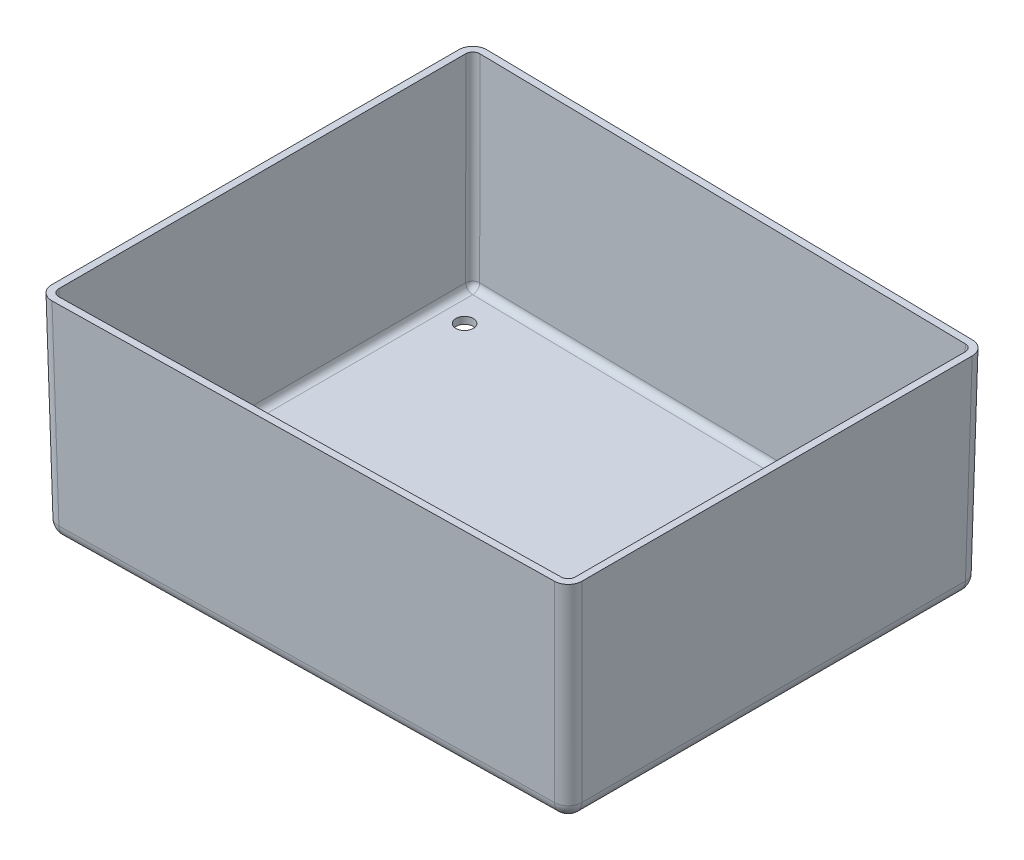
ISO-10303-21;
HEADER;
FILE_DESCRIPTION(('STEP AP214'),'2;1');
FILE_NAME('part.step','',(''),(''),'','','');
FILE_SCHEMA(('AUTOMOTIVE_DESIGN { 1 0 10303 214 1 1 1 1 }'));
ENDSEC;
DATA;
#1=APPLICATION_CONTEXT('core data for automotive mechanical design processes');
#2=APPLICATION_PROTOCOL_DEFINITION('international standard','automotive_design',2000,#1);
#3=PRODUCT_CONTEXT('',#1,'mechanical');
#4=PRODUCT('Part','Part','',(#3));
#5=PRODUCT_RELATED_PRODUCT_CATEGORY('part','',(#4));
#6=PRODUCT_DEFINITION_FORMATION('','',#4);
#7=PRODUCT_DEFINITION_CONTEXT('part definition',#1,'design');
#8=PRODUCT_DEFINITION('design','',#6,#7);
#9=PRODUCT_DEFINITION_SHAPE('','',#8);
#10=(LENGTH_UNIT() NAMED_UNIT(*) SI_UNIT(.MILLI.,.METRE.));
#11=(NAMED_UNIT(*) PLANE_ANGLE_UNIT() SI_UNIT($,.RADIAN.));
#12=(NAMED_UNIT(*) SI_UNIT($,.STERADIAN.) SOLID_ANGLE_UNIT());
#13=UNCERTAINTY_MEASURE_WITH_UNIT(LENGTH_MEASURE(1.E-05),#10,'distance_accuracy_value','');
#14=(GEOMETRIC_REPRESENTATION_CONTEXT(3) GLOBAL_UNCERTAINTY_ASSIGNED_CONTEXT((#13)) GLOBAL_UNIT_ASSIGNED_CONTEXT((#10,
#11,#12)) REPRESENTATION_CONTEXT('',''));
#15=CARTESIAN_POINT('',(0.,0.,0.));
#16=DIRECTION('',(0.,0.,1.));
#17=DIRECTION('',(1.,0.,0.));
#18=AXIS2_PLACEMENT_3D('',#15,#16,#17);
#19=CARTESIAN_POINT('',(-10247.3666463624,0.,-8079.38717390687));
#20=DIRECTION('',(-0.999847695156391,-0.0174524064372835,0.));
#21=DIRECTION('',(0.0174524064372835,-0.999847695156391,0.));
#22=AXIS2_PLACEMENT_3D('',#19,#20,#21);
#23=PLANE('',#22);
#24=DIRECTION('',(0.,0.,1.));
#25=VECTOR('',#24,1.);
#26=CARTESIAN_POINT('',(-10247.3666463624,0.,-8079.38717390687));
#27=LINE('',#26,#25);
#28=CARTESIAN_POINT('',(-10247.3666463624,0.,-7699.40344835078));
#29=VERTEX_POINT('',#28);
#30=CARTESIAN_POINT('',(-10247.3666463624,0.,22020.6291005371));
#31=VERTEX_POINT('',#30);
#32=EDGE_CURVE('E281',#29,#31,#27,.T.);
#33=ORIENTED_EDGE('',*,*,#32,.F.);
#34=DIRECTION('',(-0.0174495637852973,0.999684839733171,-0.0180481004919366));
#35=VECTOR('',#34,1.);
#36=CARTESIAN_POINT('',(-10247.4863151997,6.855823099923,-7699.52722194357));
#37=LINE('',#36,#35);
#38=CARTESIAN_POINT('',(-9998.77629580969,-14241.7316449403,-7442.28621130668));
#39=VERTEX_POINT('',#38);
#40=EDGE_CURVE('E60',#29,#39,#37,.F.);
#41=ORIENTED_EDGE('',*,*,#40,.T.);
#42=DIRECTION('',(0.,0.,1.));
#43=VECTOR('',#42,1.);
#44=CARTESIAN_POINT('',(-9998.77629580969,-14241.7316449403,-8079.38717390687));
#45=LINE('',#44,#43);
#46=CARTESIAN_POINT('',(-9998.77629580968,-14241.7316449403,21763.5118634929));
#47=VERTEX_POINT('',#46);
#48=EDGE_CURVE('E324',#39,#47,#45,.T.);
#49=ORIENTED_EDGE('',*,*,#48,.T.);
#50=DIRECTION('',(-0.0174495637852973,0.999684839733171,0.0180481004919366));
#51=VECTOR('',#50,1.);
#52=CARTESIAN_POINT('',(-10237.8872036668,-543.0769083081,22010.8245039018));
#53=LINE('',#52,#51);
#54=EDGE_CURVE('E322',#47,#31,#53,.T.);
#55=ORIENTED_EDGE('',*,*,#54,.T.);
#56=EDGE_LOOP('',(#33,#41,#49,#55));
#57=FACE_BOUND('',#56,.T.);
#58=ADVANCED_FACE('F35',(#57),#23,.T.);
#59=CARTESIAN_POINT('',(27852.6333536376,0.,-8079.38717390687));
#60=DIRECTION('',(0.017145254619604,-0.0177490206932787,-0.999695459881888));
#61=DIRECTION('',(0.,0.999842427401299,-0.0177516300174659));
#62=AXIS2_PLACEMENT_3D('',#59,#60,#61);
#63=PLANE('',#62);
#64=DIRECTION('',(-0.999852962994745,0.,-0.0171479558732175));
#65=VECTOR('',#64,1.);
#66=CARTESIAN_POINT('',(27848.2979737445,-14242.0330050244,-7826.60238346854));
#67=LINE('',#66,#65);
#68=CARTESIAN_POINT('',(26605.6173234996,-14242.0330050244,-7847.91495015942));
#69=VERTEX_POINT('',#68);
#70=CARTESIAN_POINT('',(-8965.51145883727,-14242.0330050244,-8457.97679854668));
#71=VERTEX_POINT('',#70);
#72=EDGE_CURVE('E318',#69,#71,#67,.T.);
#73=ORIENTED_EDGE('',*,*,#72,.T.);
#74=DIRECTION('',(-0.0174495637852973,0.999684839733171,-0.0180481004919366));
#75=VECTOR('',#74,1.);
#76=CARTESIAN_POINT('',(-9202.62051300037,-658.064389714291,-8703.21891976747));
#77=LINE('',#76,#75);
#78=CARTESIAN_POINT('',(-9214.10706964979,0.,-8715.09947628256));
#79=VERTEX_POINT('',#78);
#80=EDGE_CURVE('E320',#71,#79,#77,.T.);
#81=ORIENTED_EDGE('',*,*,#80,.T.);
#82=DIRECTION('',(-0.999852962994745,0.,-0.0171479558732175));
#83=VECTOR('',#82,1.);
#84=CARTESIAN_POINT('',(27852.6333536376,0.,-8079.38717390687));
#85=LINE('',#84,#83);
#86=CARTESIAN_POINT('',(26854.2129343121,0.,-8096.51056097194));
#87=VERTEX_POINT('',#86);
#88=EDGE_CURVE('E289',#87,#79,#85,.T.);
#89=ORIENTED_EDGE('',*,*,#88,.F.);
#90=DIRECTION('',(0.0174497491606827,0.999695459881888,-0.0174497491606827));
#91=VECTOR('',#90,1.);
#92=CARTESIAN_POINT('',(26854.5117331212,17.1181723067483,-8096.80935978101));
#93=LINE('',#92,#91);
#94=EDGE_CURVE('E316',#87,#69,#93,.F.);
#95=ORIENTED_EDGE('',*,*,#94,.T.);
#96=EDGE_LOOP('',(#73,#81,#89,#95));
#97=FACE_BOUND('',#96,.T.);
#98=ADVANCED_FACE('F393',(#97),#63,.T.);
#99=CARTESIAN_POINT('',(27852.6333536376,0.,-8079.38717390687));
#100=DIRECTION('',(0.999847695156391,-0.0174524064372835,0.));
#101=DIRECTION('',(0.0174524064372835,0.999847695156391,0.));
#102=AXIS2_PLACEMENT_3D('',#99,#100,#101);
#103=PLANE('',#102);
#104=DIRECTION('',(0.,0.,-1.));
#105=VECTOR('',#104,1.);
#106=CARTESIAN_POINT('',(27604.0430030849,-14241.7316449403,-8079.38717390687));
#107=LINE('',#106,#105);
#108=CARTESIAN_POINT('',(27604.0430030849,-14241.7316449403,21153.4500151057));
#109=VERTEX_POINT('',#108);
#110=CARTESIAN_POINT('',(27604.0430030849,-14241.7316449403,-6832.22436291942));
#111=VERTEX_POINT('',#110);
#112=EDGE_CURVE('E312',#109,#111,#107,.T.);
#113=ORIENTED_EDGE('',*,*,#112,.T.);
#114=DIRECTION('',(0.0174497491606827,0.999695459881888,-0.0174497491606827));
#115=VECTOR('',#114,1.);
#116=CARTESIAN_POINT('',(27852.9374127065,17.4195323908395,-7081.11877254101));
#117=LINE('',#116,#115);
#118=CARTESIAN_POINT('',(27852.6333536376,0.,-7080.81471347211));
#119=VERTEX_POINT('',#118);
#120=EDGE_CURVE('E314',#111,#119,#117,.T.);
#121=ORIENTED_EDGE('',*,*,#120,.T.);
#122=DIRECTION('',(0.,0.,-1.));
#123=VECTOR('',#122,1.);
#124=CARTESIAN_POINT('',(27852.6333536376,0.,-8079.38717390687));
#125=LINE('',#124,#123);
#126=CARTESIAN_POINT('',(27852.6333536376,0.,21402.0403656584));
#127=VERTEX_POINT('',#126);
#128=EDGE_CURVE('E286',#127,#119,#125,.T.);
#129=ORIENTED_EDGE('',*,*,#128,.F.);
#130=DIRECTION('',(0.0174497491606827,0.999695459881888,0.0174497491606827));
#131=VECTOR('',#130,1.);
#132=CARTESIAN_POINT('',(27843.6564433354,-514.286846775295,21393.0634553562));
#133=LINE('',#132,#131);
#134=EDGE_CURVE('E310',#127,#109,#133,.F.);
#135=ORIENTED_EDGE('',*,*,#134,.T.);
#136=EDGE_LOOP('',(#113,#121,#129,#135));
#137=FACE_BOUND('',#136,.T.);
#138=ADVANCED_FACE('F398',(#137),#103,.T.);
#139=CARTESIAN_POINT('',(27852.6333536376,0.,22400.6128260931));
#140=DIRECTION('',(0.0171452546196043,-0.0177490206932787,0.999695459881888));
#141=DIRECTION('',(0.,-0.999842427401299,-0.0177516300174659));
#142=AXIS2_PLACEMENT_3D('',#139,#140,#141);
#143=PLANE('',#142);
#144=DIRECTION('',(0.999852962994745,0.,-0.0171479558732177));
#145=VECTOR('',#144,1.);
#146=CARTESIAN_POINT('',(27848.2979737445,-14242.0330050244,22147.8280356548));
#147=LINE('',#146,#145);
#148=CARTESIAN_POINT('',(-8965.51145883727,-14242.0330050244,22779.2024507329));
#149=VERTEX_POINT('',#148);
#150=CARTESIAN_POINT('',(26605.6173234996,-14242.0330050244,22169.1406023457));
#151=VERTEX_POINT('',#150);
#152=EDGE_CURVE('E296',#149,#151,#147,.T.);
#153=ORIENTED_EDGE('',*,*,#152,.T.);
#154=DIRECTION('',(0.0174497491606827,0.999695459881888,0.0174497491606827));
#155=VECTOR('',#154,1.);
#156=CARTESIAN_POINT('',(26854.5117331212,17.1181723067484,22418.0350119673));
#157=LINE('',#156,#155);
#158=CARTESIAN_POINT('',(26854.2129343121,0.,22417.7362131582));
#159=VERTEX_POINT('',#158);
#160=EDGE_CURVE('E299',#151,#159,#157,.T.);
#161=ORIENTED_EDGE('',*,*,#160,.T.);
#162=DIRECTION('',(0.999852962994745,0.,-0.0171479558732177));
#163=VECTOR('',#162,1.);
#164=CARTESIAN_POINT('',(27852.6333536376,0.,22400.6128260931));
#165=LINE('',#164,#163);
#166=CARTESIAN_POINT('',(-9214.1070696498,0.,23036.3251284688));
#167=VERTEX_POINT('',#166);
#168=EDGE_CURVE('E284',#167,#159,#165,.T.);
#169=ORIENTED_EDGE('',*,*,#168,.F.);
#170=DIRECTION('',(-0.0174495637852973,0.999684839733171,0.0180481004919366));
#171=VECTOR('',#170,1.);
#172=CARTESIAN_POINT('',(-9202.62051300037,-658.064389714291,23024.4445719537));
#173=LINE('',#172,#171);
#174=EDGE_CURVE('E294',#167,#149,#173,.F.);
#175=ORIENTED_EDGE('',*,*,#174,.T.);
#176=EDGE_LOOP('',(#153,#161,#169,#175));
#177=FACE_BOUND('',#176,.T.);
#178=ADVANCED_FACE('F407',(#177),#143,.T.);
#179=CARTESIAN_POINT('',(0.,-15240.,0.));
#180=DIRECTION('',(0.,-1.,0.));
#181=DIRECTION('',(0.,0.,-1.));
#182=AXIS2_PLACEMENT_3D('',#179,#180,#181);
#183=PLANE('',#182);
#184=CARTESIAN_POINT('',(25445.1977448061,-15240.,19648.828893685));
#185=DIRECTION('',(0.,-1.,0.));
#186=DIRECTION('',(0.,0.,-1.));
#187=AXIS2_PLACEMENT_3D('',#184,#185,#186);
#188=CIRCLE('',#187,635.000000000003);
#189=CARTESIAN_POINT('',(25445.1977448061,-15240.,19013.828893685));
#190=VERTEX_POINT('',#189);
#191=EDGE_CURVE('E601',#190,#190,#188,.T.);
#192=ORIENTED_EDGE('',*,*,#191,.F.);
#193=EDGE_LOOP('',(#192));
#194=FACE_BOUND('',#193,.T.);
#195=CARTESIAN_POINT('',(-7458.93103753079,-15240.,19648.828893685));
#196=DIRECTION('',(0.,-1.,0.));
#197=DIRECTION('',(0.,0.,-1.));
#198=AXIS2_PLACEMENT_3D('',#195,#196,#197);
#199=CIRCLE('',#198,635.);
#200=CARTESIAN_POINT('',(-7458.93103753079,-15240.,19013.828893685));
#201=VERTEX_POINT('',#200);
#202=EDGE_CURVE('E598',#201,#201,#199,.T.);
#203=ORIENTED_EDGE('',*,*,#202,.F.);
#204=EDGE_LOOP('',(#203));
#205=FACE_BOUND('',#204,.T.);
#206=CARTESIAN_POINT('',(-7458.93103753079,-15240.,-5327.60324149877));
#207=DIRECTION('',(0.,-1.,0.));
#208=DIRECTION('',(0.,0.,-1.));
#209=AXIS2_PLACEMENT_3D('',#206,#207,#208);
#210=CIRCLE('',#209,635.);
#211=CARTESIAN_POINT('',(-7458.93103753079,-15240.,-5962.60324149877));
#212=VERTEX_POINT('',#211);
#213=EDGE_CURVE('E596',#212,#212,#210,.T.);
#214=ORIENTED_EDGE('',*,*,#213,.F.);
#215=EDGE_LOOP('',(#214));
#216=FACE_BOUND('',#215,.T.);
#217=CARTESIAN_POINT('',(25445.1977448061,-15240.,-5327.60324149877));
#218=DIRECTION('',(0.,-1.,0.));
#219=DIRECTION('',(0.,0.,-1.));
#220=AXIS2_PLACEMENT_3D('',#217,#218,#219);
#221=CIRCLE('',#220,635.000000000002);
#222=CARTESIAN_POINT('',(25445.1977448061,-15240.,-5962.60324149877));
#223=VERTEX_POINT('',#222);
#224=EDGE_CURVE('E368',#223,#223,#221,.T.);
#225=ORIENTED_EDGE('',*,*,#224,.F.);
#226=EDGE_LOOP('',(#225));
#227=FACE_BOUND('',#226,.T.);
#228=DIRECTION('',(0.,0.,-1.));
#229=VECTOR('',#228,1.);
#230=CARTESIAN_POINT('',(26588.197744806,-15240.,-3.09908969234334E-12));
#231=LINE('',#230,#229);
#232=CARTESIAN_POINT('',(26588.197744806,-15240.,-6832.22436291942));
#233=VERTEX_POINT('',#232);
#234=CARTESIAN_POINT('',(26588.1977448061,-15240.,21153.4500151057));
#235=VERTEX_POINT('',#234);
#236=EDGE_CURVE('E305',#233,#235,#231,.F.);
#237=ORIENTED_EDGE('',*,*,#236,.T.);
#238=DIRECTION('',(0.999852962994745,0.,-0.0171479558732177));
#239=VECTOR('',#238,1.);
#240=CARTESIAN_POINT('',(370.503414562687,-15240.,21603.0959951765));
#241=LINE('',#240,#239);
#242=CARTESIAN_POINT('',(-8982.93103753079,-15240.,21763.5118634929));
#243=VERTEX_POINT('',#242);
#244=EDGE_CURVE('E307',#235,#243,#241,.F.);
#245=ORIENTED_EDGE('',*,*,#244,.T.);
#246=DIRECTION('',(0.,0.,1.));
#247=VECTOR('',#246,1.);
#248=CARTESIAN_POINT('',(-8982.93103753079,-15240.,1.57056013645459E-12));
#249=LINE('',#248,#247);
#250=CARTESIAN_POINT('',(-8982.93103753079,-15240.,-7442.28621130668));
#251=VERTEX_POINT('',#250);
#252=EDGE_CURVE('E301',#243,#251,#249,.F.);
#253=ORIENTED_EDGE('',*,*,#252,.T.);
#254=DIRECTION('',(-0.999852962994745,0.,-0.0171479558732175));
#255=VECTOR('',#254,1.);
#256=CARTESIAN_POINT('',(124.959778338937,-15240.,-7286.08153363005));
#257=LINE('',#256,#255);
#258=EDGE_CURVE('E303',#251,#233,#257,.F.);
#259=ORIENTED_EDGE('',*,*,#258,.T.);
#260=EDGE_LOOP('',(#237,#245,#253,#259));
#261=FACE_BOUND('',#260,.T.);
#262=ADVANCED_FACE('F410',(#194,#205,#216,#227,#261),#183,.T.);
#263=CARTESIAN_POINT('',(0.,0.,0.));
#264=DIRECTION('',(0.,-1.,0.));
#265=DIRECTION('',(0.,0.,-1.));
#266=AXIS2_PLACEMENT_3D('',#263,#264,#265);
#267=PLANE('',#266);
#268=DIRECTION('',(-0.999852962994745,0.,-0.0171479558732175));
#269=VECTOR('',#268,1.);
#270=CARTESIAN_POINT('',(27843.920819601,0.,-7571.3818445183));
#271=LINE('',#270,#269);
#272=CARTESIAN_POINT('',(26845.3457613286,0.,-7588.50788371517));
#273=VERTEX_POINT('',#272);
#274=CARTESIAN_POINT('',(-9222.65947535977,0.,-8207.0914006167));
#275=VERTEX_POINT('',#274);
#276=EDGE_CURVE('E254',#273,#275,#271,.T.);
#277=ORIENTED_EDGE('',*,*,#276,.F.);
#278=CARTESIAN_POINT('',(26836.478588345,0.,-7080.50520645839));
#279=DIRECTION('',(0.,-1.,0.));
#280=DIRECTION('',(0.707106781186547,0.,-0.707106781186548));
#281=AXIS2_PLACEMENT_3D('',#278,#279,#280);
#282=ELLIPSE('',#281,508.154753508653,508.);
#283=CARTESIAN_POINT('',(27344.5559709913,0.,-7080.65995996525));
#284=VERTEX_POINT('',#283);
#285=EDGE_CURVE('E274',#284,#273,#282,.F.);
#286=ORIENTED_EDGE('',*,*,#285,.F.);
#287=DIRECTION('',(0.,0.,-1.));
#288=VECTOR('',#287,1.);
#289=CARTESIAN_POINT('',(27344.5559709913,0.,-8079.38717390687));
#290=LINE('',#289,#288);
#291=CARTESIAN_POINT('',(27344.5559709913,0.,21401.8856121515));
#292=VERTEX_POINT('',#291);
#293=EDGE_CURVE('E52',#292,#284,#290,.T.);
#294=ORIENTED_EDGE('',*,*,#293,.F.);
#295=CARTESIAN_POINT('',(26836.478588345,0.,21401.7308586446));
#296=DIRECTION('',(0.,-1.,0.));
#297=DIRECTION('',(0.707106781186548,0.,0.707106781186548));
#298=AXIS2_PLACEMENT_3D('',#295,#296,#297);
#299=ELLIPSE('',#298,508.154753508653,508.);
#300=CARTESIAN_POINT('',(26845.3457613286,0.,21909.7335359014));
#301=VERTEX_POINT('',#300);
#302=EDGE_CURVE('E270',#301,#292,#299,.F.);
#303=ORIENTED_EDGE('',*,*,#302,.F.);
#304=DIRECTION('',(0.999852962994745,0.,-0.0171479558732177));
#305=VECTOR('',#304,1.);
#306=CARTESIAN_POINT('',(27843.920819601,0.,21892.6074967046));
#307=LINE('',#306,#305);
#308=CARTESIAN_POINT('',(-9222.65947535977,0.,22528.317052803));
#309=VERTEX_POINT('',#308);
#310=EDGE_CURVE('E268',#309,#301,#307,.T.);
#311=ORIENTED_EDGE('',*,*,#310,.F.);
#312=CARTESIAN_POINT('',(-9231.21188106975,0.,22020.3089771371));
#313=DIRECTION('',(0.,-1.,0.));
#314=DIRECTION('',(-0.6950852422926,0.,0.718927330087706));
#315=AXIS2_PLACEMENT_3D('',#312,#313,#314);
#316=ELLIPSE('',#315,508.160151889061,508.);
#317=CARTESIAN_POINT('',(-9739.28926371606,0.,22020.4690388371));
#318=VERTEX_POINT('',#317);
#319=EDGE_CURVE('E186',#318,#309,#316,.F.);
#320=ORIENTED_EDGE('',*,*,#319,.F.);
#321=DIRECTION('',(0.,0.,1.));
#322=VECTOR('',#321,1.);
#323=CARTESIAN_POINT('',(-9739.28926371607,0.,-8079.38717390687));
#324=LINE('',#323,#322);
#325=CARTESIAN_POINT('',(-9739.28926371606,0.,-7699.24338665081));
#326=VERTEX_POINT('',#325);
#327=EDGE_CURVE('E244',#326,#318,#324,.T.);
#328=ORIENTED_EDGE('',*,*,#327,.F.);
#329=CARTESIAN_POINT('',(-9231.21188106975,0.,-7699.08332495084));
#330=DIRECTION('',(0.,-1.,0.));
#331=DIRECTION('',(-0.695085242292601,0.,-0.718927330087705));
#332=AXIS2_PLACEMENT_3D('',#329,#330,#331);
#333=ELLIPSE('',#332,508.160151889061,508.);
#334=EDGE_CURVE('E181',#275,#326,#333,.F.);
#335=ORIENTED_EDGE('',*,*,#334,.F.);
#336=EDGE_LOOP('',(#277,#286,#294,#303,#311,#320,#328,#335));
#337=FACE_BOUND('',#336,.T.);
#338=ORIENTED_EDGE('',*,*,#88,.T.);
#339=CARTESIAN_POINT('',(-9231.21188106975,0.,-7699.08332495084));
#340=DIRECTION('',(0.,-1.,0.));
#341=DIRECTION('',(-0.695085242292601,0.,-0.718927330087705));
#342=AXIS2_PLACEMENT_3D('',#339,#340,#341);
#343=ELLIPSE('',#342,1016.32030377812,1016.);
#344=EDGE_CURVE('E11',#79,#29,#343,.F.);
#345=ORIENTED_EDGE('',*,*,#344,.T.);
#346=ORIENTED_EDGE('',*,*,#32,.T.);
#347=CARTESIAN_POINT('',(-9231.21188106975,0.,22020.3089771371));
#348=DIRECTION('',(0.,-1.,0.));
#349=DIRECTION('',(-0.6950852422926,0.,0.718927330087706));
#350=AXIS2_PLACEMENT_3D('',#347,#348,#349);
#351=ELLIPSE('',#350,1016.32030377812,1016.);
#352=EDGE_CURVE('E327',#31,#167,#351,.F.);
#353=ORIENTED_EDGE('',*,*,#352,.T.);
#354=ORIENTED_EDGE('',*,*,#168,.T.);
#355=CARTESIAN_POINT('',(26836.478588345,0.,21401.7308586446));
#356=DIRECTION('',(0.,-1.,0.));
#357=DIRECTION('',(0.707106781186548,0.,0.707106781186548));
#358=AXIS2_PLACEMENT_3D('',#355,#356,#357);
#359=ELLIPSE('',#358,1016.30950701731,1016.);
#360=EDGE_CURVE('E329',#159,#127,#359,.F.);
#361=ORIENTED_EDGE('',*,*,#360,.T.);
#362=ORIENTED_EDGE('',*,*,#128,.T.);
#363=CARTESIAN_POINT('',(26836.478588345,0.,-7080.50520645839));
#364=DIRECTION('',(0.,-1.,0.));
#365=DIRECTION('',(0.707106781186547,0.,-0.707106781186548));
#366=AXIS2_PLACEMENT_3D('',#363,#364,#365);
#367=ELLIPSE('',#366,1016.30950701731,1016.);
#368=EDGE_CURVE('E44',#119,#87,#367,.F.);
#369=ORIENTED_EDGE('',*,*,#368,.T.);
#370=EDGE_LOOP('',(#338,#345,#346,#353,#354,#361,#362,#369));
#371=FACE_BOUND('',#370,.T.);
#372=ADVANCED_FACE('F403',(#337,#371),#267,.F.);
#373=CARTESIAN_POINT('',(-9220.04009169389,-640.031384689919,-7687.52833252747));
#374=DIRECTION('',(-0.0174495637852973,0.999684839733171,-0.0180481004919366));
#375=DIRECTION('',(0.,0.0180508488280581,0.999837070155226));
#376=AXIS2_PLACEMENT_3D('',#373,#374,#375);
#377=CYLINDRICAL_SURFACE('',#376,1016.);
#378=ORIENTED_EDGE('',*,*,#344,.F.);
#379=ORIENTED_EDGE('',*,*,#80,.F.);
#380=CARTESIAN_POINT('',(-8982.93103753079,-14224.,-7442.28621130668));
#381=DIRECTION('',(0.0174495637852975,-0.999684839733171,0.0180481004919366));
#382=DIRECTION('',(0.,-0.0180508488280582,-0.999837070155226));
#383=AXIS2_PLACEMENT_3D('',#380,#381,#382);
#384=CIRCLE('',#383,1016.);
#385=EDGE_CURVE('E359',#39,#71,#384,.T.);
#386=ORIENTED_EDGE('',*,*,#385,.F.);
#387=ORIENTED_EDGE('',*,*,#40,.F.);
#388=EDGE_LOOP('',(#378,#379,#386,#387));
#389=FACE_BOUND('',#388,.T.);
#390=ADVANCED_FACE('F37',(#389),#377,.T.);
#391=CARTESIAN_POINT('',(26837.0921544276,35.1511773311196,-7081.11877254101));
#392=DIRECTION('',(0.0174497491606827,0.999695459881888,-0.0174497491606827));
#393=DIRECTION('',(0.,0.0174524064372835,0.999847695156391));
#394=AXIS2_PLACEMENT_3D('',#391,#392,#393);
#395=CYLINDRICAL_SURFACE('',#394,1016.);
#396=ORIENTED_EDGE('',*,*,#368,.F.);
#397=ORIENTED_EDGE('',*,*,#120,.F.);
#398=CARTESIAN_POINT('',(26588.1977448061,-14224.,-6832.22436291942));
#399=DIRECTION('',(-0.0174497491606829,-0.999695459881888,0.0174497491606826));
#400=DIRECTION('',(0.999847695156391,-0.0174524064372838,0.));
#401=AXIS2_PLACEMENT_3D('',#398,#399,#400);
#402=CIRCLE('',#401,1016.);
#403=EDGE_CURVE('E356',#69,#111,#402,.T.);
#404=ORIENTED_EDGE('',*,*,#403,.F.);
#405=ORIENTED_EDGE('',*,*,#94,.F.);
#406=EDGE_LOOP('',(#396,#397,#404,#405));
#407=FACE_BOUND('',#406,.T.);
#408=ADVANCED_FACE('F451',(#407),#395,.T.);
#409=CARTESIAN_POINT('',(27830.878395051,-14224.,-6810.91179622854));
#410=DIRECTION('',(-0.999852962994745,0.,-0.0171479558732175));
#411=DIRECTION('',(-0.0171479558732175,0.,0.999852962994745));
#412=AXIS2_PLACEMENT_3D('',#409,#410,#411);
#413=CYLINDRICAL_SURFACE('',#412,1016.);
#414=CARTESIAN_POINT('',(-8982.93103753079,-14224.,-7442.28621130668));
#415=DIRECTION('',(-0.999852962994745,0.,-0.0171479558732182));
#416=DIRECTION('',(-0.0171479558732182,0.,0.999852962994745));
#417=AXIS2_PLACEMENT_3D('',#414,#415,#416);
#418=CIRCLE('',#417,1016.);
#419=EDGE_CURVE('E285',#71,#251,#418,.T.);
#420=ORIENTED_EDGE('',*,*,#419,.F.);
#421=ORIENTED_EDGE('',*,*,#72,.F.);
#422=CARTESIAN_POINT('',(26588.197744806,-14224.,-6832.22436291942));
#423=DIRECTION('',(0.999852962994745,0.,0.0171479558732198));
#424=DIRECTION('',(0.0171479558732198,0.,-0.999852962994745));
#425=AXIS2_PLACEMENT_3D('',#422,#423,#424);
#426=CIRCLE('',#425,1016.);
#427=EDGE_CURVE('E353',#233,#69,#426,.T.);
#428=ORIENTED_EDGE('',*,*,#427,.F.);
#429=ORIENTED_EDGE('',*,*,#258,.F.);
#430=EDGE_LOOP('',(#420,#421,#428,#429));
#431=FACE_BOUND('',#430,.T.);
#432=ADVANCED_FACE('F448',(#431),#413,.T.);
#433=CARTESIAN_POINT('',(-8982.93103753079,-14224.,-7442.28621130668));
#434=DIRECTION('',(0.,0.,1.));
#435=DIRECTION('',(1.,0.,0.));
#436=AXIS2_PLACEMENT_3D('',#433,#434,#435);
#437=SPHERICAL_SURFACE('',#436,1016.);
#438=ORIENTED_EDGE('',*,*,#385,.T.);
#439=ORIENTED_EDGE('',*,*,#419,.T.);
#440=CARTESIAN_POINT('',(-8982.93103753079,-14224.,-7442.28621130668));
#441=DIRECTION('',(0.,0.,-1.));
#442=DIRECTION('',(-1.,0.,0.));
#443=AXIS2_PLACEMENT_3D('',#440,#441,#442);
#444=CIRCLE('',#443,1016.);
#445=EDGE_CURVE('E350',#39,#251,#444,.F.);
#446=ORIENTED_EDGE('',*,*,#445,.F.);
#447=EDGE_LOOP('',(#438,#439,#446));
#448=FACE_BOUND('',#447,.T.);
#449=ADVANCED_FACE('F444',(#448),#437,.T.);
#450=CARTESIAN_POINT('',(26588.197744806,-14224.,-6832.22436291942));
#451=DIRECTION('',(0.,0.,1.));
#452=DIRECTION('',(1.,0.,0.));
#453=AXIS2_PLACEMENT_3D('',#450,#451,#452);
#454=SPHERICAL_SURFACE('',#453,1016.);
#455=ORIENTED_EDGE('',*,*,#427,.T.);
#456=ORIENTED_EDGE('',*,*,#403,.T.);
#457=CARTESIAN_POINT('',(26588.197744806,-14224.,-6832.22436291942));
#458=DIRECTION('',(0.,0.,-1.));
#459=DIRECTION('',(-1.,0.,0.));
#460=AXIS2_PLACEMENT_3D('',#457,#458,#459);
#461=CIRCLE('',#460,1016.);
#462=EDGE_CURVE('E347',#233,#111,#461,.F.);
#463=ORIENTED_EDGE('',*,*,#462,.F.);
#464=EDGE_LOOP('',(#455,#456,#463));
#465=FACE_BOUND('',#464,.T.);
#466=ADVANCED_FACE('F440',(#465),#454,.T.);
#467=CARTESIAN_POINT('',(-8982.93103753079,-14224.,-8079.38717390687));
#468=DIRECTION('',(0.,0.,1.));
#469=DIRECTION('',(1.,0.,0.));
#470=AXIS2_PLACEMENT_3D('',#467,#468,#469);
#471=CYLINDRICAL_SURFACE('',#470,1016.);
#472=ORIENTED_EDGE('',*,*,#445,.T.);
#473=ORIENTED_EDGE('',*,*,#252,.F.);
#474=CARTESIAN_POINT('',(-8982.93103753079,-14224.,21763.5118634929));
#475=DIRECTION('',(0.,0.,1.));
#476=DIRECTION('',(0.,-1.,0.));
#477=AXIS2_PLACEMENT_3D('',#474,#475,#476);
#478=CIRCLE('',#477,1016.);
#479=EDGE_CURVE('E344',#47,#243,#478,.T.);
#480=ORIENTED_EDGE('',*,*,#479,.F.);
#481=ORIENTED_EDGE('',*,*,#48,.F.);
#482=EDGE_LOOP('',(#472,#473,#480,#481));
#483=FACE_BOUND('',#482,.T.);
#484=ADVANCED_FACE('F436',(#483),#471,.T.);
#485=CARTESIAN_POINT('',(-9222.04194538794,-525.345263367819,22010.8245039018));
#486=DIRECTION('',(-0.0174495637852973,0.999684839733171,0.0180481004919366));
#487=DIRECTION('',(0.,-0.0180508488280581,0.999837070155226));
#488=AXIS2_PLACEMENT_3D('',#485,#486,#487);
#489=CYLINDRICAL_SURFACE('',#488,1016.);
#490=ORIENTED_EDGE('',*,*,#352,.F.);
#491=ORIENTED_EDGE('',*,*,#54,.F.);
#492=CARTESIAN_POINT('',(-8982.93103753079,-14224.,21763.5118634929));
#493=DIRECTION('',(0.0174495637852974,-0.999684839733171,-0.0180481004919365));
#494=DIRECTION('',(0.,0.018050848828058,-0.999837070155226));
#495=AXIS2_PLACEMENT_3D('',#492,#493,#494);
#496=CIRCLE('',#495,1016.);
#497=EDGE_CURVE('E341',#149,#47,#496,.T.);
#498=ORIENTED_EDGE('',*,*,#497,.F.);
#499=ORIENTED_EDGE('',*,*,#174,.F.);
#500=EDGE_LOOP('',(#490,#491,#498,#499));
#501=FACE_BOUND('',#500,.T.);
#502=ADVANCED_FACE('F432',(#501),#489,.T.);
#503=CARTESIAN_POINT('',(26837.0921544276,35.1511773311196,21402.3444247273));
#504=DIRECTION('',(0.0174497491606827,0.999695459881888,0.0174497491606827));
#505=DIRECTION('',(0.,-0.0174524064372835,0.999847695156391));
#506=AXIS2_PLACEMENT_3D('',#503,#504,#505);
#507=CYLINDRICAL_SURFACE('',#506,1016.);
#508=ORIENTED_EDGE('',*,*,#360,.F.);
#509=ORIENTED_EDGE('',*,*,#160,.F.);
#510=CARTESIAN_POINT('',(26588.1977448061,-14224.,21153.4500151057));
#511=DIRECTION('',(-0.0174497491606829,-0.999695459881888,-0.0174497491606826));
#512=DIRECTION('',(0.999847695156391,-0.0174524064372837,0.));
#513=AXIS2_PLACEMENT_3D('',#510,#511,#512);
#514=CIRCLE('',#513,1016.);
#515=EDGE_CURVE('E338',#109,#151,#514,.T.);
#516=ORIENTED_EDGE('',*,*,#515,.F.);
#517=ORIENTED_EDGE('',*,*,#134,.F.);
#518=EDGE_LOOP('',(#508,#509,#516,#517));
#519=FACE_BOUND('',#518,.T.);
#520=ADVANCED_FACE('F428',(#519),#507,.T.);
#521=CARTESIAN_POINT('',(26588.197744806,-14224.,-8079.38717390687));
#522=DIRECTION('',(0.,0.,-1.));
#523=DIRECTION('',(-1.,0.,0.));
#524=AXIS2_PLACEMENT_3D('',#521,#522,#523);
#525=CYLINDRICAL_SURFACE('',#524,1016.);
#526=ORIENTED_EDGE('',*,*,#462,.T.);
#527=ORIENTED_EDGE('',*,*,#112,.F.);
#528=CARTESIAN_POINT('',(26588.1977448061,-14224.,21153.4500151057));
#529=DIRECTION('',(0.,0.,1.));
#530=DIRECTION('',(1.,0.,0.));
#531=AXIS2_PLACEMENT_3D('',#528,#529,#530);
#532=CIRCLE('',#531,1016.);
#533=EDGE_CURVE('E335',#235,#109,#532,.T.);
#534=ORIENTED_EDGE('',*,*,#533,.F.);
#535=ORIENTED_EDGE('',*,*,#236,.F.);
#536=EDGE_LOOP('',(#526,#527,#534,#535));
#537=FACE_BOUND('',#536,.T.);
#538=ADVANCED_FACE('F424',(#537),#525,.T.);
#539=CARTESIAN_POINT('',(-8982.93103753079,-14224.,21763.5118634929));
#540=DIRECTION('',(0.,0.,1.));
#541=DIRECTION('',(1.,0.,0.));
#542=AXIS2_PLACEMENT_3D('',#539,#540,#541);
#543=SPHERICAL_SURFACE('',#542,1016.);
#544=ORIENTED_EDGE('',*,*,#497,.T.);
#545=ORIENTED_EDGE('',*,*,#479,.T.);
#546=CARTESIAN_POINT('',(-8982.93103753079,-14224.,21763.5118634929));
#547=DIRECTION('',(-0.999852962994745,0.,0.0171479558732198));
#548=DIRECTION('',(0.0171479558732198,0.,0.999852962994745));
#549=AXIS2_PLACEMENT_3D('',#546,#547,#548);
#550=CIRCLE('',#549,1016.);
#551=EDGE_CURVE('E333',#149,#243,#550,.F.);
#552=ORIENTED_EDGE('',*,*,#551,.F.);
#553=EDGE_LOOP('',(#544,#545,#552));
#554=FACE_BOUND('',#553,.T.);
#555=ADVANCED_FACE('F420',(#554),#543,.T.);
#556=CARTESIAN_POINT('',(26588.1977448061,-14224.,21153.4500151057));
#557=DIRECTION('',(0.,0.,1.));
#558=DIRECTION('',(1.,0.,0.));
#559=AXIS2_PLACEMENT_3D('',#556,#557,#558);
#560=SPHERICAL_SURFACE('',#559,1016.);
#561=ORIENTED_EDGE('',*,*,#533,.T.);
#562=ORIENTED_EDGE('',*,*,#515,.T.);
#563=CARTESIAN_POINT('',(26588.1977448061,-14224.,21153.4500151057));
#564=DIRECTION('',(0.999852962994745,0.,-0.0171479558732163));
#565=DIRECTION('',(-0.0171479558732163,0.,-0.999852962994745));
#566=AXIS2_PLACEMENT_3D('',#563,#564,#565);
#567=CIRCLE('',#566,1016.);
#568=EDGE_CURVE('E280',#235,#151,#567,.F.);
#569=ORIENTED_EDGE('',*,*,#568,.F.);
#570=EDGE_LOOP('',(#561,#562,#569));
#571=FACE_BOUND('',#570,.T.);
#572=ADVANCED_FACE('F416',(#571),#560,.T.);
#573=CARTESIAN_POINT('',(27830.878395051,-14224.,21132.1374484148));
#574=DIRECTION('',(0.999852962994745,0.,-0.0171479558732177));
#575=DIRECTION('',(-0.0171479558732177,0.,-0.999852962994745));
#576=AXIS2_PLACEMENT_3D('',#573,#574,#575);
#577=CYLINDRICAL_SURFACE('',#576,1016.);
#578=ORIENTED_EDGE('',*,*,#551,.T.);
#579=ORIENTED_EDGE('',*,*,#244,.F.);
#580=ORIENTED_EDGE('',*,*,#568,.T.);
#581=ORIENTED_EDGE('',*,*,#152,.F.);
#582=EDGE_LOOP('',(#578,#579,#580,#581));
#583=FACE_BOUND('',#582,.T.);
#584=ADVANCED_FACE('F413',(#583),#577,.T.);
#585=CARTESIAN_POINT('',(-9739.44401722292,8.86582247014004,-8079.38717390687));
#586=DIRECTION('',(-0.999847695156391,-0.0174524064372835,0.));
#587=DIRECTION('',(0.0174524064372835,-0.999847695156391,0.));
#588=AXIS2_PLACEMENT_3D('',#585,#586,#587);
#589=PLANE('',#588);
#590=ORIENTED_EDGE('',*,*,#327,.T.);
#591=DIRECTION('',(-0.0174495637852973,0.999684839733171,0.0180481004919366));
#592=VECTOR('',#591,1.);
#593=CARTESIAN_POINT('',(-9729.96457452738,-534.211085837959,22010.8245039018));
#594=LINE('',#593,#592);
#595=CARTESIAN_POINT('',(-9490.85366667023,-14232.8658224701,21763.5118634929));
#596=VERTEX_POINT('',#595);
#597=EDGE_CURVE('E210',#596,#318,#594,.T.);
#598=ORIENTED_EDGE('',*,*,#597,.F.);
#599=DIRECTION('',(0.,0.,1.));
#600=VECTOR('',#599,1.);
#601=CARTESIAN_POINT('',(-9490.85366667024,-14232.8658224701,-8079.38717390687));
#602=LINE('',#601,#600);
#603=CARTESIAN_POINT('',(-9490.85366667024,-14232.8658224701,-7442.28621130668));
#604=VERTEX_POINT('',#603);
#605=EDGE_CURVE('E187',#604,#596,#602,.T.);
#606=ORIENTED_EDGE('',*,*,#605,.F.);
#607=DIRECTION('',(-0.0174495637852973,0.999684839733171,-0.0180481004919366));
#608=VECTOR('',#607,1.);
#609=CARTESIAN_POINT('',(-9727.96272083334,-648.897207160059,-7687.52833252747));
#610=LINE('',#609,#608);
#611=EDGE_CURVE('E176',#326,#604,#610,.F.);
#612=ORIENTED_EDGE('',*,*,#611,.F.);
#613=EDGE_LOOP('',(#590,#598,#606,#612));
#614=FACE_BOUND('',#613,.T.);
#615=ADVANCED_FACE('F209',(#614),#589,.F.);
#616=CARTESIAN_POINT('',(27843.9235642909,9.0165025121856,-7571.54188028687));
#617=DIRECTION('',(0.017145254619604,-0.0177490206932787,-0.999695459881888));
#618=DIRECTION('',(0.,0.999842427401299,-0.0177516300174659));
#619=AXIS2_PLACEMENT_3D('',#616,#617,#618);
#620=PLANE('',#619);
#621=DIRECTION('',(-0.999852962994745,0.,-0.0171479558732175));
#622=VECTOR('',#621,1.);
#623=CARTESIAN_POINT('',(27839.5881843977,-14233.0165025122,-7318.75708984854));
#624=LINE('',#623,#622);
#625=CARTESIAN_POINT('',(26596.9075341528,-14233.0165025122,-7340.06965653942));
#626=VERTEX_POINT('',#625);
#627=CARTESIAN_POINT('',(-8974.22124818402,-14233.0165025122,-7950.13150492668));
#628=VERTEX_POINT('',#627);
#629=EDGE_CURVE('E217',#626,#628,#624,.T.);
#630=ORIENTED_EDGE('',*,*,#629,.F.);
#631=DIRECTION('',(0.0174497491606827,0.999695459881888,-0.0174497491606827));
#632=VECTOR('',#631,1.);
#633=CARTESIAN_POINT('',(26845.8019437744,26.134674818934,-7588.96406616101));
#634=LINE('',#633,#632);
#635=EDGE_CURVE('E220',#273,#626,#634,.F.);
#636=ORIENTED_EDGE('',*,*,#635,.F.);
#637=ORIENTED_EDGE('',*,*,#276,.T.);
#638=DIRECTION('',(-0.0174495637852973,0.999684839733171,-0.0180481004919366));
#639=VECTOR('',#638,1.);
#640=CARTESIAN_POINT('',(-9211.33030234713,-649.047887202105,-8195.37362614747));
#641=LINE('',#640,#639);
#642=EDGE_CURVE('E213',#628,#275,#641,.T.);
#643=ORIENTED_EDGE('',*,*,#642,.F.);
#644=EDGE_LOOP('',(#630,#636,#637,#643));
#645=FACE_BOUND('',#644,.T.);
#646=ADVANCED_FACE('F555',(#645),#620,.F.);
#647=CARTESIAN_POINT('',(27344.7107244982,8.86582247014004,-8079.38717390687));
#648=DIRECTION('',(0.999847695156391,-0.0174524064372835,0.));
#649=DIRECTION('',(0.0174524064372835,0.999847695156391,0.));
#650=AXIS2_PLACEMENT_3D('',#647,#648,#649);
#651=PLANE('',#650);
#652=DIRECTION('',(0.,0.,1.));
#653=VECTOR('',#652,1.);
#654=CARTESIAN_POINT('',(27096.1203739455,-14232.8658224701,-8079.38717390687));
#655=LINE('',#654,#653);
#656=CARTESIAN_POINT('',(27096.1203739455,-14232.8658224701,21153.4500151057));
#657=VERTEX_POINT('',#656);
#658=CARTESIAN_POINT('',(27096.1203739455,-14232.8658224701,-6832.22436291942));
#659=VERTEX_POINT('',#658);
#660=EDGE_CURVE('E224',#657,#659,#655,.F.);
#661=ORIENTED_EDGE('',*,*,#660,.F.);
#662=DIRECTION('',(0.0174497491606827,0.999695459881888,0.0174497491606827));
#663=VECTOR('',#662,1.);
#664=CARTESIAN_POINT('',(27345.0147835671,26.2853548609796,21402.3444247273));
#665=LINE('',#664,#663);
#666=EDGE_CURVE('E228',#292,#657,#665,.F.);
#667=ORIENTED_EDGE('',*,*,#666,.F.);
#668=ORIENTED_EDGE('',*,*,#293,.T.);
#669=DIRECTION('',(0.0174497491606827,0.999695459881888,-0.0174497491606827));
#670=VECTOR('',#669,1.);
#671=CARTESIAN_POINT('',(27345.0147835671,26.2853548609795,-7081.11877254101));
#672=LINE('',#671,#670);
#673=EDGE_CURVE('E222',#659,#284,#672,.T.);
#674=ORIENTED_EDGE('',*,*,#673,.F.);
#675=EDGE_LOOP('',(#661,#667,#668,#674));
#676=FACE_BOUND('',#675,.T.);
#677=ADVANCED_FACE('F551',(#676),#651,.F.);
#678=CARTESIAN_POINT('',(27843.9235642909,9.0165025121856,21892.7675324731));
#679=DIRECTION('',(0.0171452546196043,-0.0177490206932787,0.999695459881888));
#680=DIRECTION('',(0.,-0.999842427401299,-0.0177516300174659));
#681=AXIS2_PLACEMENT_3D('',#678,#679,#680);
#682=PLANE('',#681);
#683=DIRECTION('',(0.999852962994745,0.,-0.0171479558732177));
#684=VECTOR('',#683,1.);
#685=CARTESIAN_POINT('',(27839.5881843977,-14233.0165025122,21639.9827420348));
#686=LINE('',#685,#684);
#687=CARTESIAN_POINT('',(-8974.22124818402,-14233.0165025122,22271.3571571129));
#688=VERTEX_POINT('',#687);
#689=CARTESIAN_POINT('',(26596.9075341528,-14233.0165025122,21661.2953087257));
#690=VERTEX_POINT('',#689);
#691=EDGE_CURVE('E253',#688,#690,#686,.T.);
#692=ORIENTED_EDGE('',*,*,#691,.F.);
#693=DIRECTION('',(-0.0174495637852973,0.999684839733171,0.0180481004919366));
#694=VECTOR('',#693,1.);
#695=CARTESIAN_POINT('',(-9213.33215604118,-534.361765880005,22518.6697975218));
#696=LINE('',#695,#694);
#697=EDGE_CURVE('E251',#309,#688,#696,.F.);
#698=ORIENTED_EDGE('',*,*,#697,.F.);
#699=ORIENTED_EDGE('',*,*,#310,.T.);
#700=DIRECTION('',(0.0174497491606827,0.999695459881888,0.0174497491606827));
#701=VECTOR('',#700,1.);
#702=CARTESIAN_POINT('',(26845.8019437744,26.134674818934,21910.1897183473));
#703=LINE('',#702,#701);
#704=EDGE_CURVE('E242',#690,#301,#703,.T.);
#705=ORIENTED_EDGE('',*,*,#704,.F.);
#706=EDGE_LOOP('',(#692,#698,#699,#705));
#707=FACE_BOUND('',#706,.T.);
#708=ADVANCED_FACE('F548',(#707),#682,.F.);
#709=CARTESIAN_POINT('',(0.,-14732.,0.));
#710=DIRECTION('',(0.,-1.,0.));
#711=DIRECTION('',(0.,0.,-1.));
#712=AXIS2_PLACEMENT_3D('',#709,#710,#711);
#713=PLANE('',#712);
#714=CARTESIAN_POINT('',(25445.1977448061,-14732.,19648.828893685));
#715=DIRECTION('',(0.,-1.,0.));
#716=DIRECTION('',(0.,0.,-1.));
#717=AXIS2_PLACEMENT_3D('',#714,#715,#716);
#718=CIRCLE('',#717,635.000000000003);
#719=CARTESIAN_POINT('',(25445.1977448061,-14732.,19013.828893685));
#720=VERTEX_POINT('',#719);
#721=EDGE_CURVE('E39',#720,#720,#718,.T.);
#722=ORIENTED_EDGE('',*,*,#721,.T.);
#723=EDGE_LOOP('',(#722));
#724=FACE_BOUND('',#723,.T.);
#725=CARTESIAN_POINT('',(-7458.93103753079,-14732.,19648.828893685));
#726=DIRECTION('',(0.,-1.,0.));
#727=DIRECTION('',(0.,0.,-1.));
#728=AXIS2_PLACEMENT_3D('',#725,#726,#727);
#729=CIRCLE('',#728,635.);
#730=CARTESIAN_POINT('',(-7458.93103753079,-14732.,19013.828893685));
#731=VERTEX_POINT('',#730);
#732=EDGE_CURVE('E370',#731,#731,#729,.T.);
#733=ORIENTED_EDGE('',*,*,#732,.T.);
#734=EDGE_LOOP('',(#733));
#735=FACE_BOUND('',#734,.T.);
#736=CARTESIAN_POINT('',(-7458.93103753079,-14732.,-5327.60324149877));
#737=DIRECTION('',(0.,-1.,0.));
#738=DIRECTION('',(0.,0.,-1.));
#739=AXIS2_PLACEMENT_3D('',#736,#737,#738);
#740=CIRCLE('',#739,635.);
#741=CARTESIAN_POINT('',(-7458.93103753079,-14732.,-5962.60324149877));
#742=VERTEX_POINT('',#741);
#743=EDGE_CURVE('E367',#742,#742,#740,.T.);
#744=ORIENTED_EDGE('',*,*,#743,.T.);
#745=EDGE_LOOP('',(#744));
#746=FACE_BOUND('',#745,.T.);
#747=CARTESIAN_POINT('',(25445.1977448061,-14732.,-5327.60324149877));
#748=DIRECTION('',(0.,-1.,0.));
#749=DIRECTION('',(0.,0.,-1.));
#750=AXIS2_PLACEMENT_3D('',#747,#748,#749);
#751=CIRCLE('',#750,635.000000000002);
#752=CARTESIAN_POINT('',(25445.1977448061,-14732.,-5962.60324149877));
#753=VERTEX_POINT('',#752);
#754=EDGE_CURVE('E364',#753,#753,#751,.T.);
#755=ORIENTED_EDGE('',*,*,#754,.T.);
#756=EDGE_LOOP('',(#755));
#757=FACE_BOUND('',#756,.T.);
#758=DIRECTION('',(0.,0.,-1.));
#759=VECTOR('',#758,1.);
#760=CARTESIAN_POINT('',(26588.197744806,-14732.,0.));
#761=LINE('',#760,#759);
#762=CARTESIAN_POINT('',(26588.197744806,-14732.,-6832.22436291942));
#763=VERTEX_POINT('',#762);
#764=CARTESIAN_POINT('',(26588.1977448061,-14732.,21153.4500151057));
#765=VERTEX_POINT('',#764);
#766=EDGE_CURVE('E236',#763,#765,#761,.F.);
#767=ORIENTED_EDGE('',*,*,#766,.F.);
#768=DIRECTION('',(-0.999852962994745,0.,-0.0171479558732175));
#769=VECTOR('',#768,1.);
#770=CARTESIAN_POINT('',(27830.878395051,-14732.,-6810.91179622854));
#771=LINE('',#770,#769);
#772=CARTESIAN_POINT('',(-8982.93103753079,-14732.,-7442.28621130668));
#773=VERTEX_POINT('',#772);
#774=EDGE_CURVE('E238',#773,#763,#771,.F.);
#775=ORIENTED_EDGE('',*,*,#774,.F.);
#776=DIRECTION('',(0.,0.,-1.));
#777=VECTOR('',#776,1.);
#778=CARTESIAN_POINT('',(-8982.93103753079,-14732.,0.));
#779=LINE('',#778,#777);
#780=CARTESIAN_POINT('',(-8982.93103753079,-14732.,21763.5118634929));
#781=VERTEX_POINT('',#780);
#782=EDGE_CURVE('E204',#781,#773,#779,.T.);
#783=ORIENTED_EDGE('',*,*,#782,.F.);
#784=DIRECTION('',(0.999852962994745,0.,-0.0171479558732177));
#785=VECTOR('',#784,1.);
#786=CARTESIAN_POINT('',(27830.878395051,-14732.,21132.1374484148));
#787=LINE('',#786,#785);
#788=EDGE_CURVE('E230',#765,#781,#787,.F.);
#789=ORIENTED_EDGE('',*,*,#788,.F.);
#790=EDGE_LOOP('',(#767,#775,#783,#789));
#791=FACE_BOUND('',#790,.T.);
#792=ADVANCED_FACE('F377',(#724,#735,#746,#757,#791),#713,.F.);
#793=CARTESIAN_POINT('',(-9220.04009169389,-640.031384689919,-7687.52833252747));
#794=DIRECTION('',(-0.0174495637852973,0.999684839733171,-0.0180481004919366));
#795=DIRECTION('',(0.,0.0180508488280581,0.999837070155226));
#796=AXIS2_PLACEMENT_3D('',#793,#794,#795);
#797=CYLINDRICAL_SURFACE('',#796,508.);
#798=ORIENTED_EDGE('',*,*,#334,.T.);
#799=ORIENTED_EDGE('',*,*,#611,.T.);
#800=CARTESIAN_POINT('',(-8982.93103753079,-14224.,-7442.28621130668));
#801=DIRECTION('',(-0.0174495637852973,0.999684839733171,-0.0180481004919366));
#802=DIRECTION('',(0.,0.0180508488280581,0.999837070155226));
#803=AXIS2_PLACEMENT_3D('',#800,#801,#802);
#804=CIRCLE('',#803,508.);
#805=EDGE_CURVE('E179',#604,#628,#804,.F.);
#806=ORIENTED_EDGE('',*,*,#805,.T.);
#807=ORIENTED_EDGE('',*,*,#642,.T.);
#808=EDGE_LOOP('',(#798,#799,#806,#807));
#809=FACE_BOUND('',#808,.T.);
#810=ADVANCED_FACE('F178',(#809),#797,.F.);
#811=CARTESIAN_POINT('',(26837.0921544276,35.1511773311196,-7081.11877254101));
#812=DIRECTION('',(0.0174497491606827,0.999695459881888,-0.0174497491606827));
#813=DIRECTION('',(0.,0.0174524064372835,0.999847695156391));
#814=AXIS2_PLACEMENT_3D('',#811,#812,#813);
#815=CYLINDRICAL_SURFACE('',#814,508.);
#816=ORIENTED_EDGE('',*,*,#285,.T.);
#817=ORIENTED_EDGE('',*,*,#635,.T.);
#818=CARTESIAN_POINT('',(26588.1977448061,-14224.,-6832.22436291942));
#819=DIRECTION('',(0.0174497491606827,0.999695459881888,-0.0174497491606827));
#820=DIRECTION('',(0.,0.0174524064372835,0.999847695156391));
#821=AXIS2_PLACEMENT_3D('',#818,#819,#820);
#822=CIRCLE('',#821,508.);
#823=EDGE_CURVE('E197',#626,#659,#822,.F.);
#824=ORIENTED_EDGE('',*,*,#823,.T.);
#825=ORIENTED_EDGE('',*,*,#673,.T.);
#826=EDGE_LOOP('',(#816,#817,#824,#825));
#827=FACE_BOUND('',#826,.T.);
#828=ADVANCED_FACE('F539',(#827),#815,.F.);
#829=CARTESIAN_POINT('',(27830.878395051,-14224.,-6810.91179622854));
#830=DIRECTION('',(-0.999852962994745,0.,-0.0171479558732175));
#831=DIRECTION('',(-0.0171479558732175,0.,0.999852962994745));
#832=AXIS2_PLACEMENT_3D('',#829,#830,#831);
#833=CYLINDRICAL_SURFACE('',#832,508.);
#834=CARTESIAN_POINT('',(-8982.93103753079,-14224.,-7442.28621130668));
#835=DIRECTION('',(-0.999852962994745,0.,-0.0171479558732175));
#836=DIRECTION('',(-0.0171479558732175,0.,0.999852962994745));
#837=AXIS2_PLACEMENT_3D('',#834,#835,#836);
#838=CIRCLE('',#837,508.);
#839=EDGE_CURVE('E196',#628,#773,#838,.T.);
#840=ORIENTED_EDGE('',*,*,#839,.T.);
#841=ORIENTED_EDGE('',*,*,#774,.T.);
#842=CARTESIAN_POINT('',(26588.197744806,-14224.,-6832.22436291942));
#843=DIRECTION('',(-0.999852962994745,0.,-0.0171479558732175));
#844=DIRECTION('',(-0.0171479558732175,0.,0.999852962994745));
#845=AXIS2_PLACEMENT_3D('',#842,#843,#844);
#846=CIRCLE('',#845,508.);
#847=EDGE_CURVE('E206',#763,#626,#846,.F.);
#848=ORIENTED_EDGE('',*,*,#847,.T.);
#849=ORIENTED_EDGE('',*,*,#629,.T.);
#850=EDGE_LOOP('',(#840,#841,#848,#849));
#851=FACE_BOUND('',#850,.T.);
#852=ADVANCED_FACE('F536',(#851),#833,.F.);
#853=CARTESIAN_POINT('',(-8982.93103753079,-14224.,-7442.28621130668));
#854=DIRECTION('',(0.,0.,1.));
#855=DIRECTION('',(1.,0.,0.));
#856=AXIS2_PLACEMENT_3D('',#853,#854,#855);
#857=SPHERICAL_SURFACE('',#856,508.);
#858=ORIENTED_EDGE('',*,*,#805,.F.);
#859=CARTESIAN_POINT('',(-8982.93103753079,-14224.,-7442.28621130668));
#860=DIRECTION('',(0.,0.,1.));
#861=DIRECTION('',(1.,0.,0.));
#862=AXIS2_PLACEMENT_3D('',#859,#860,#861);
#863=CIRCLE('',#862,508.);
#864=EDGE_CURVE('E194',#604,#773,#863,.T.);
#865=ORIENTED_EDGE('',*,*,#864,.T.);
#866=ORIENTED_EDGE('',*,*,#839,.F.);
#867=EDGE_LOOP('',(#858,#865,#866));
#868=FACE_BOUND('',#867,.T.);
#869=ADVANCED_FACE('F193',(#868),#857,.F.);
#870=CARTESIAN_POINT('',(26588.197744806,-14224.,-6832.22436291942));
#871=DIRECTION('',(0.,0.,1.));
#872=DIRECTION('',(1.,0.,0.));
#873=AXIS2_PLACEMENT_3D('',#870,#871,#872);
#874=SPHERICAL_SURFACE('',#873,508.);
#875=ORIENTED_EDGE('',*,*,#847,.F.);
#876=CARTESIAN_POINT('',(26588.197744806,-14224.,-6832.22436291942));
#877=DIRECTION('',(0.,0.,-1.));
#878=DIRECTION('',(-1.,0.,0.));
#879=AXIS2_PLACEMENT_3D('',#876,#877,#878);
#880=CIRCLE('',#879,508.);
#881=EDGE_CURVE('E207',#763,#659,#880,.F.);
#882=ORIENTED_EDGE('',*,*,#881,.T.);
#883=ORIENTED_EDGE('',*,*,#823,.F.);
#884=EDGE_LOOP('',(#875,#882,#883));
#885=FACE_BOUND('',#884,.T.);
#886=ADVANCED_FACE('F530',(#885),#874,.F.);
#887=CARTESIAN_POINT('',(-8982.93103753079,-14224.,-8079.38717390687));
#888=DIRECTION('',(0.,0.,1.));
#889=DIRECTION('',(1.,0.,0.));
#890=AXIS2_PLACEMENT_3D('',#887,#888,#889);
#891=CYLINDRICAL_SURFACE('',#890,508.);
#892=ORIENTED_EDGE('',*,*,#864,.F.);
#893=ORIENTED_EDGE('',*,*,#605,.T.);
#894=CARTESIAN_POINT('',(-8982.93103753079,-14224.,21763.5118634929));
#895=DIRECTION('',(0.,0.,1.));
#896=DIRECTION('',(1.,0.,0.));
#897=AXIS2_PLACEMENT_3D('',#894,#895,#896);
#898=CIRCLE('',#897,508.);
#899=EDGE_CURVE('E235',#596,#781,#898,.T.);
#900=ORIENTED_EDGE('',*,*,#899,.T.);
#901=ORIENTED_EDGE('',*,*,#782,.T.);
#902=EDGE_LOOP('',(#892,#893,#900,#901));
#903=FACE_BOUND('',#902,.T.);
#904=ADVANCED_FACE('F200',(#903),#891,.F.);
#905=CARTESIAN_POINT('',(-9222.04194538794,-525.345263367819,22010.8245039018));
#906=DIRECTION('',(-0.0174495637852973,0.999684839733171,0.0180481004919366));
#907=DIRECTION('',(0.,-0.0180508488280581,0.999837070155226));
#908=AXIS2_PLACEMENT_3D('',#905,#906,#907);
#909=CYLINDRICAL_SURFACE('',#908,508.);
#910=ORIENTED_EDGE('',*,*,#319,.T.);
#911=ORIENTED_EDGE('',*,*,#697,.T.);
#912=CARTESIAN_POINT('',(-8982.93103753079,-14224.,21763.5118634929));
#913=DIRECTION('',(-0.0174495637852973,0.999684839733171,0.0180481004919366));
#914=DIRECTION('',(0.,-0.0180508488280581,0.999837070155226));
#915=AXIS2_PLACEMENT_3D('',#912,#913,#914);
#916=CIRCLE('',#915,508.);
#917=EDGE_CURVE('E247',#688,#596,#916,.F.);
#918=ORIENTED_EDGE('',*,*,#917,.T.);
#919=ORIENTED_EDGE('',*,*,#597,.T.);
#920=EDGE_LOOP('',(#910,#911,#918,#919));
#921=FACE_BOUND('',#920,.T.);
#922=ADVANCED_FACE('F523',(#921),#909,.F.);
#923=CARTESIAN_POINT('',(26837.0921544276,35.1511773311196,21402.3444247273));
#924=DIRECTION('',(0.0174497491606827,0.999695459881888,0.0174497491606827));
#925=DIRECTION('',(0.,-0.0174524064372835,0.999847695156391));
#926=AXIS2_PLACEMENT_3D('',#923,#924,#925);
#927=CYLINDRICAL_SURFACE('',#926,508.);
#928=ORIENTED_EDGE('',*,*,#302,.T.);
#929=ORIENTED_EDGE('',*,*,#666,.T.);
#930=CARTESIAN_POINT('',(26588.1977448061,-14224.,21153.4500151057));
#931=DIRECTION('',(0.0174497491606827,0.999695459881888,0.0174497491606827));
#932=DIRECTION('',(0.,-0.0174524064372835,0.999847695156391));
#933=AXIS2_PLACEMENT_3D('',#930,#931,#932);
#934=CIRCLE('',#933,508.);
#935=EDGE_CURVE('E250',#657,#690,#934,.F.);
#936=ORIENTED_EDGE('',*,*,#935,.T.);
#937=ORIENTED_EDGE('',*,*,#704,.T.);
#938=EDGE_LOOP('',(#928,#929,#936,#937));
#939=FACE_BOUND('',#938,.T.);
#940=ADVANCED_FACE('F519',(#939),#927,.F.);
#941=CARTESIAN_POINT('',(26588.197744806,-14224.,-8079.38717390687));
#942=DIRECTION('',(0.,0.,-1.));
#943=DIRECTION('',(-1.,0.,0.));
#944=AXIS2_PLACEMENT_3D('',#941,#942,#943);
#945=CYLINDRICAL_SURFACE('',#944,508.);
#946=ORIENTED_EDGE('',*,*,#881,.F.);
#947=ORIENTED_EDGE('',*,*,#766,.T.);
#948=CARTESIAN_POINT('',(26588.1977448061,-14224.,21153.4500151057));
#949=DIRECTION('',(0.,0.,1.));
#950=DIRECTION('',(1.,0.,0.));
#951=AXIS2_PLACEMENT_3D('',#948,#949,#950);
#952=CIRCLE('',#951,508.);
#953=EDGE_CURVE('E260',#765,#657,#952,.T.);
#954=ORIENTED_EDGE('',*,*,#953,.T.);
#955=ORIENTED_EDGE('',*,*,#660,.T.);
#956=EDGE_LOOP('',(#946,#947,#954,#955));
#957=FACE_BOUND('',#956,.T.);
#958=ADVANCED_FACE('F515',(#957),#945,.F.);
#959=CARTESIAN_POINT('',(-8982.93103753079,-14224.,21763.5118634929));
#960=DIRECTION('',(0.,0.,1.));
#961=DIRECTION('',(1.,0.,0.));
#962=AXIS2_PLACEMENT_3D('',#959,#960,#961);
#963=SPHERICAL_SURFACE('',#962,508.);
#964=ORIENTED_EDGE('',*,*,#917,.F.);
#965=CARTESIAN_POINT('',(-8982.93103753079,-14224.,21763.5118634929));
#966=DIRECTION('',(0.999852962994745,0.,-0.0171479558732177));
#967=DIRECTION('',(-0.0171479558732177,0.,-0.999852962994745));
#968=AXIS2_PLACEMENT_3D('',#965,#966,#967);
#969=CIRCLE('',#968,508.);
#970=EDGE_CURVE('E263',#688,#781,#969,.T.);
#971=ORIENTED_EDGE('',*,*,#970,.T.);
#972=ORIENTED_EDGE('',*,*,#899,.F.);
#973=EDGE_LOOP('',(#964,#971,#972));
#974=FACE_BOUND('',#973,.T.);
#975=ADVANCED_FACE('F511',(#974),#963,.F.);
#976=CARTESIAN_POINT('',(26588.1977448061,-14224.,21153.4500151057));
#977=DIRECTION('',(0.,0.,1.));
#978=DIRECTION('',(1.,0.,0.));
#979=AXIS2_PLACEMENT_3D('',#976,#977,#978);
#980=SPHERICAL_SURFACE('',#979,508.);
#981=ORIENTED_EDGE('',*,*,#953,.F.);
#982=CARTESIAN_POINT('',(26588.1977448061,-14224.,21153.4500151057));
#983=DIRECTION('',(0.999852962994745,0.,-0.0171479558732177));
#984=DIRECTION('',(-0.0171479558732177,0.,-0.999852962994745));
#985=AXIS2_PLACEMENT_3D('',#982,#983,#984);
#986=CIRCLE('',#985,508.);
#987=EDGE_CURVE('E264',#765,#690,#986,.F.);
#988=ORIENTED_EDGE('',*,*,#987,.T.);
#989=ORIENTED_EDGE('',*,*,#935,.F.);
#990=EDGE_LOOP('',(#981,#988,#989));
#991=FACE_BOUND('',#990,.T.);
#992=ADVANCED_FACE('F507',(#991),#980,.F.);
#993=CARTESIAN_POINT('',(27830.878395051,-14224.,21132.1374484148));
#994=DIRECTION('',(0.999852962994745,0.,-0.0171479558732177));
#995=DIRECTION('',(-0.0171479558732177,0.,-0.999852962994745));
#996=AXIS2_PLACEMENT_3D('',#993,#994,#995);
#997=CYLINDRICAL_SURFACE('',#996,508.);
#998=ORIENTED_EDGE('',*,*,#970,.F.);
#999=ORIENTED_EDGE('',*,*,#691,.T.);
#1000=ORIENTED_EDGE('',*,*,#987,.F.);
#1001=ORIENTED_EDGE('',*,*,#788,.T.);
#1002=EDGE_LOOP('',(#998,#999,#1000,#1001));
#1003=FACE_BOUND('',#1002,.T.);
#1004=ADVANCED_FACE('F503',(#1003),#997,.F.);
#1005=CARTESIAN_POINT('',(25445.1977448061,0.,-5327.60324149877));
#1006=DIRECTION('',(0.,-1.,0.));
#1007=DIRECTION('',(0.,0.,-1.));
#1008=AXIS2_PLACEMENT_3D('',#1005,#1006,#1007);
#1009=CYLINDRICAL_SURFACE('',#1008,635.000000000002);
#1010=ORIENTED_EDGE('',*,*,#224,.T.);
#1011=EDGE_LOOP('',(#1010));
#1012=FACE_BOUND('',#1011,.T.);
#1013=ORIENTED_EDGE('',*,*,#754,.F.);
#1014=EDGE_LOOP('',(#1013));
#1015=FACE_BOUND('',#1014,.T.);
#1016=ADVANCED_FACE('F506',(#1012,#1015),#1009,.F.);
#1017=CARTESIAN_POINT('',(-7458.93103753079,0.,-5327.60324149877));
#1018=DIRECTION('',(0.,-1.,0.));
#1019=DIRECTION('',(0.,0.,-1.));
#1020=AXIS2_PLACEMENT_3D('',#1017,#1018,#1019);
#1021=CYLINDRICAL_SURFACE('',#1020,635.);
#1022=ORIENTED_EDGE('',*,*,#213,.T.);
#1023=EDGE_LOOP('',(#1022));
#1024=FACE_BOUND('',#1023,.T.);
#1025=ORIENTED_EDGE('',*,*,#743,.F.);
#1026=EDGE_LOOP('',(#1025));
#1027=FACE_BOUND('',#1026,.T.);
#1028=ADVANCED_FACE('F387',(#1024,#1027),#1021,.F.);
#1029=CARTESIAN_POINT('',(-7458.93103753079,0.,19648.828893685));
#1030=DIRECTION('',(0.,-1.,0.));
#1031=DIRECTION('',(0.,0.,-1.));
#1032=AXIS2_PLACEMENT_3D('',#1029,#1030,#1031);
#1033=CYLINDRICAL_SURFACE('',#1032,635.);
#1034=ORIENTED_EDGE('',*,*,#202,.T.);
#1035=EDGE_LOOP('',(#1034));
#1036=FACE_BOUND('',#1035,.T.);
#1037=ORIENTED_EDGE('',*,*,#732,.F.);
#1038=EDGE_LOOP('',(#1037));
#1039=FACE_BOUND('',#1038,.T.);
#1040=ADVANCED_FACE('F381',(#1036,#1039),#1033,.F.);
#1041=CARTESIAN_POINT('',(25445.1977448061,0.,19648.828893685));
#1042=DIRECTION('',(0.,-1.,0.));
#1043=DIRECTION('',(0.,0.,-1.));
#1044=AXIS2_PLACEMENT_3D('',#1041,#1042,#1043);
#1045=CYLINDRICAL_SURFACE('',#1044,635.000000000003);
#1046=ORIENTED_EDGE('',*,*,#191,.T.);
#1047=EDGE_LOOP('',(#1046));
#1048=FACE_BOUND('',#1047,.T.);
#1049=ORIENTED_EDGE('',*,*,#721,.F.);
#1050=EDGE_LOOP('',(#1049));
#1051=FACE_BOUND('',#1050,.T.);
#1052=ADVANCED_FACE('F379',(#1048,#1051),#1045,.F.);
#1053=CLOSED_SHELL('',(#58,#98,#138,#178,#262,#372,#390,#408,#432,#449,#466,#484,#502,#520,#538,
#555,#572,#584,#615,#646,#677,#708,#792,#810,#828,#852,#869,#886,#904,#922,#940,#958,#975,#992,
#1004,#1016,#1028,#1040,#1052));
#1054=MANIFOLD_SOLID_BREP('B2',#1053);
#1055=ADVANCED_BREP_SHAPE_REPRESENTATION('',(#18,#1054),#14);
#1056=SHAPE_DEFINITION_REPRESENTATION(#9,#1055);
ENDSEC;
END-ISO-10303-21;
